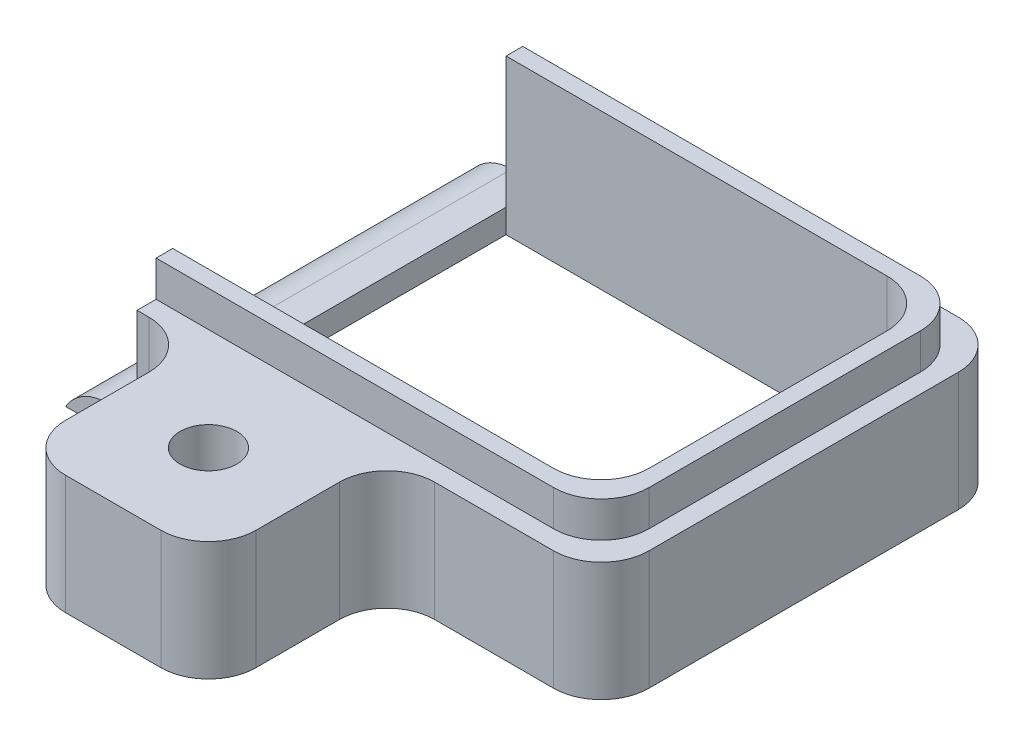
ISO-10303-21;
HEADER;
FILE_DESCRIPTION(('STEP AP214'),'2;1');
FILE_NAME('part.step','',(''),(''),'','','');
FILE_SCHEMA(('AUTOMOTIVE_DESIGN { 1 0 10303 214 1 1 1 1 }'));
ENDSEC;
DATA;
#1=APPLICATION_CONTEXT('core data for automotive mechanical design processes');
#2=APPLICATION_PROTOCOL_DEFINITION('international standard','automotive_design',2000,#1);
#3=PRODUCT_CONTEXT('',#1,'mechanical');
#4=PRODUCT('Part','Part','',(#3));
#5=PRODUCT_RELATED_PRODUCT_CATEGORY('part','',(#4));
#6=PRODUCT_DEFINITION_FORMATION('','',#4);
#7=PRODUCT_DEFINITION_CONTEXT('part definition',#1,'design');
#8=PRODUCT_DEFINITION('design','',#6,#7);
#9=PRODUCT_DEFINITION_SHAPE('','',#8);
#10=(LENGTH_UNIT() NAMED_UNIT(*) SI_UNIT(.MILLI.,.METRE.));
#11=(NAMED_UNIT(*) PLANE_ANGLE_UNIT() SI_UNIT($,.RADIAN.));
#12=(NAMED_UNIT(*) SI_UNIT($,.STERADIAN.) SOLID_ANGLE_UNIT());
#13=UNCERTAINTY_MEASURE_WITH_UNIT(LENGTH_MEASURE(1.E-05),#10,'distance_accuracy_value','');
#14=(GEOMETRIC_REPRESENTATION_CONTEXT(3) GLOBAL_UNCERTAINTY_ASSIGNED_CONTEXT((#13)) GLOBAL_UNIT_ASSIGNED_CONTEXT((#10,
#11,#12)) REPRESENTATION_CONTEXT('',''));
#15=CARTESIAN_POINT('',(0.,0.,0.));
#16=DIRECTION('',(0.,0.,1.));
#17=DIRECTION('',(1.,0.,0.));
#18=AXIS2_PLACEMENT_3D('',#15,#16,#17);
#19=CARTESIAN_POINT('',(5.62499999999999,2.5,-4.25));
#20=DIRECTION('',(0.,-1.,0.));
#21=DIRECTION('',(0.,0.,-1.));
#22=AXIS2_PLACEMENT_3D('',#19,#20,#21);
#23=PLANE('',#22);
#24=CARTESIAN_POINT('',(-0.875000000000002,2.5,6.));
#25=DIRECTION('',(0.,1.,0.));
#26=DIRECTION('',(0.,0.,1.));
#27=AXIS2_PLACEMENT_3D('',#24,#25,#26);
#28=CIRCLE('',#27,0.595629999999989);
#29=CARTESIAN_POINT('',(-0.875000000000002,2.5,6.59562999999999));
#30=VERTEX_POINT('',#29);
#31=EDGE_CURVE('E516',#30,#30,#28,.T.);
#32=ORIENTED_EDGE('',*,*,#31,.F.);
#33=EDGE_LOOP('',(#32));
#34=FACE_BOUND('',#33,.T.);
#35=DIRECTION('',(0.,0.,-1.));
#36=VECTOR('',#35,1.);
#37=CARTESIAN_POINT('',(5.625,2.5,4.25));
#38=LINE('',#37,#36);
#39=CARTESIAN_POINT('',(5.625,2.5,3.25));
#40=VERTEX_POINT('',#39);
#41=CARTESIAN_POINT('',(5.625,2.5,-3.25));
#42=VERTEX_POINT('',#41);
#43=EDGE_CURVE('E308',#40,#42,#38,.T.);
#44=ORIENTED_EDGE('',*,*,#43,.T.);
#45=CARTESIAN_POINT('',(4.625,2.5,-3.25));
#46=DIRECTION('',(0.,-1.,0.));
#47=DIRECTION('',(0.,0.,-1.));
#48=AXIS2_PLACEMENT_3D('',#45,#46,#47);
#49=CIRCLE('',#48,1.);
#50=CARTESIAN_POINT('',(4.62499999999999,2.5,-4.25));
#51=VERTEX_POINT('',#50);
#52=EDGE_CURVE('E367',#42,#51,#49,.F.);
#53=ORIENTED_EDGE('',*,*,#52,.T.);
#54=DIRECTION('',(-1.,0.,0.));
#55=VECTOR('',#54,1.);
#56=CARTESIAN_POINT('',(-5.625,2.5,-4.25));
#57=LINE('',#56,#55);
#58=CARTESIAN_POINT('',(-4.125,2.5,-4.25));
#59=VERTEX_POINT('',#58);
#60=EDGE_CURVE('E311',#51,#59,#57,.T.);
#61=ORIENTED_EDGE('',*,*,#60,.T.);
#62=DIRECTION('',(0.,0.,-1.));
#63=VECTOR('',#62,1.);
#64=CARTESIAN_POINT('',(-4.125,2.5,-4.25));
#65=LINE('',#64,#63);
#66=CARTESIAN_POINT('',(-4.125,2.5,-3.85));
#67=VERTEX_POINT('',#66);
#68=EDGE_CURVE('E294',#67,#59,#65,.T.);
#69=ORIENTED_EDGE('',*,*,#68,.F.);
#70=DIRECTION('',(-1.,0.,0.));
#71=VECTOR('',#70,1.);
#72=CARTESIAN_POINT('',(5.225,2.5,-3.85));
#73=LINE('',#72,#71);
#74=CARTESIAN_POINT('',(4.225,2.5,-3.85));
#75=VERTEX_POINT('',#74);
#76=EDGE_CURVE('E265',#75,#67,#73,.T.);
#77=ORIENTED_EDGE('',*,*,#76,.F.);
#78=CARTESIAN_POINT('',(4.225,2.5,-2.85));
#79=DIRECTION('',(0.,-1.,0.));
#80=DIRECTION('',(0.,0.,-1.));
#81=AXIS2_PLACEMENT_3D('',#78,#79,#80);
#82=CIRCLE('',#81,1.);
#83=CARTESIAN_POINT('',(5.225,2.5,-2.85));
#84=VERTEX_POINT('',#83);
#85=EDGE_CURVE('E415',#75,#84,#82,.T.);
#86=ORIENTED_EDGE('',*,*,#85,.T.);
#87=DIRECTION('',(0.,0.,-1.));
#88=VECTOR('',#87,1.);
#89=CARTESIAN_POINT('',(5.225,2.5,3.85));
#90=LINE('',#89,#88);
#91=CARTESIAN_POINT('',(5.225,2.5,2.85));
#92=VERTEX_POINT('',#91);
#93=EDGE_CURVE('E262',#92,#84,#90,.T.);
#94=ORIENTED_EDGE('',*,*,#93,.F.);
#95=CARTESIAN_POINT('',(4.225,2.5,2.85));
#96=DIRECTION('',(0.,-1.,0.));
#97=DIRECTION('',(0.,0.,-1.));
#98=AXIS2_PLACEMENT_3D('',#95,#96,#97);
#99=CIRCLE('',#98,1.);
#100=CARTESIAN_POINT('',(4.225,2.5,3.85));
#101=VERTEX_POINT('',#100);
#102=EDGE_CURVE('E417',#92,#101,#99,.T.);
#103=ORIENTED_EDGE('',*,*,#102,.T.);
#104=DIRECTION('',(1.,0.,0.));
#105=VECTOR('',#104,1.);
#106=CARTESIAN_POINT('',(-4.125,2.5,3.85));
#107=LINE('',#106,#105);
#108=CARTESIAN_POINT('',(-4.125,2.5,3.85));
#109=VERTEX_POINT('',#108);
#110=EDGE_CURVE('E266',#109,#101,#107,.T.);
#111=ORIENTED_EDGE('',*,*,#110,.F.);
#112=CARTESIAN_POINT('',(-4.125,2.5,4.25));
#113=VERTEX_POINT('',#112);
#114=EDGE_CURVE('E290',#113,#109,#65,.T.);
#115=ORIENTED_EDGE('',*,*,#114,.F.);
#116=DIRECTION('',(1.,0.,0.));
#117=VECTOR('',#116,1.);
#118=CARTESIAN_POINT('',(-5.625,2.5,4.25));
#119=LINE('',#118,#117);
#120=CARTESIAN_POINT('',(-3.875,2.5,4.25));
#121=VERTEX_POINT('',#120);
#122=EDGE_CURVE('E321',#113,#121,#119,.T.);
#123=ORIENTED_EDGE('',*,*,#122,.T.);
#124=CARTESIAN_POINT('',(-3.875,2.5,5.25));
#125=DIRECTION('',(0.,-1.,0.));
#126=DIRECTION('',(0.,0.,-1.));
#127=AXIS2_PLACEMENT_3D('',#124,#125,#126);
#128=CIRCLE('',#127,1.);
#129=CARTESIAN_POINT('',(-2.875,2.5,5.25));
#130=VERTEX_POINT('',#129);
#131=EDGE_CURVE('E425',#121,#130,#128,.T.);
#132=ORIENTED_EDGE('',*,*,#131,.T.);
#133=DIRECTION('',(0.,0.,-1.));
#134=VECTOR('',#133,1.);
#135=CARTESIAN_POINT('',(-2.875,2.5,8.));
#136=LINE('',#135,#134);
#137=CARTESIAN_POINT('',(-2.875,2.5,7.));
#138=VERTEX_POINT('',#137);
#139=EDGE_CURVE('E277',#138,#130,#136,.T.);
#140=ORIENTED_EDGE('',*,*,#139,.F.);
#141=CARTESIAN_POINT('',(-1.875,2.5,7.));
#142=DIRECTION('',(0.,-1.,0.));
#143=DIRECTION('',(0.,0.,-1.));
#144=AXIS2_PLACEMENT_3D('',#141,#142,#143);
#145=CIRCLE('',#144,1.);
#146=CARTESIAN_POINT('',(-1.875,2.5,8.));
#147=VERTEX_POINT('',#146);
#148=EDGE_CURVE('E358',#138,#147,#145,.F.);
#149=ORIENTED_EDGE('',*,*,#148,.T.);
#150=DIRECTION('',(-1.,0.,0.));
#151=VECTOR('',#150,1.);
#152=CARTESIAN_POINT('',(-2.875,2.5,8.));
#153=LINE('',#152,#151);
#154=CARTESIAN_POINT('',(0.124999999999998,2.5,8.));
#155=VERTEX_POINT('',#154);
#156=EDGE_CURVE('E282',#155,#147,#153,.T.);
#157=ORIENTED_EDGE('',*,*,#156,.F.);
#158=CARTESIAN_POINT('',(0.124999999999998,2.5,7.));
#159=DIRECTION('',(0.,-1.,0.));
#160=DIRECTION('',(0.,0.,-1.));
#161=AXIS2_PLACEMENT_3D('',#158,#159,#160);
#162=CIRCLE('',#161,1.);
#163=CARTESIAN_POINT('',(1.125,2.5,7.));
#164=VERTEX_POINT('',#163);
#165=EDGE_CURVE('E356',#155,#164,#162,.F.);
#166=ORIENTED_EDGE('',*,*,#165,.T.);
#167=DIRECTION('',(0.,0.,-1.));
#168=VECTOR('',#167,1.);
#169=CARTESIAN_POINT('',(1.125,2.5,8.));
#170=LINE('',#169,#168);
#171=CARTESIAN_POINT('',(1.125,2.5,5.25));
#172=VERTEX_POINT('',#171);
#173=EDGE_CURVE('E281',#164,#172,#170,.T.);
#174=ORIENTED_EDGE('',*,*,#173,.T.);
#175=CARTESIAN_POINT('',(2.125,2.5,5.25));
#176=DIRECTION('',(0.,-1.,0.));
#177=DIRECTION('',(0.,0.,-1.));
#178=AXIS2_PLACEMENT_3D('',#175,#176,#177);
#179=CIRCLE('',#178,1.);
#180=CARTESIAN_POINT('',(2.125,2.5,4.25));
#181=VERTEX_POINT('',#180);
#182=EDGE_CURVE('E419',#172,#181,#179,.T.);
#183=ORIENTED_EDGE('',*,*,#182,.T.);
#184=CARTESIAN_POINT('',(4.62499999999999,2.5,4.25));
#185=VERTEX_POINT('',#184);
#186=EDGE_CURVE('E314',#181,#185,#119,.T.);
#187=ORIENTED_EDGE('',*,*,#186,.T.);
#188=CARTESIAN_POINT('',(4.625,2.5,3.25));
#189=DIRECTION('',(0.,-1.,0.));
#190=DIRECTION('',(0.,0.,-1.));
#191=AXIS2_PLACEMENT_3D('',#188,#189,#190);
#192=CIRCLE('',#191,1.);
#193=EDGE_CURVE('E363',#185,#40,#192,.F.);
#194=ORIENTED_EDGE('',*,*,#193,.T.);
#195=EDGE_LOOP('',(#44,#53,#61,#69,#77,#86,#94,#103,#111,#115,#123,#132,#140,#149,#157,#166,
#174,#183,#187,#194));
#196=FACE_BOUND('',#195,.T.);
#197=ADVANCED_FACE('F30',(#34,#196),#23,.F.);
#198=CARTESIAN_POINT('',(-5.625,2.5,4.25));
#199=DIRECTION('',(0.,0.,-1.));
#200=DIRECTION('',(-1.,0.,0.));
#201=AXIS2_PLACEMENT_3D('',#198,#199,#200);
#202=PLANE('',#201);
#203=DIRECTION('',(1.,0.,0.));
#204=VECTOR('',#203,1.);
#205=CARTESIAN_POINT('',(-5.625,0.5,4.25));
#206=LINE('',#205,#204);
#207=CARTESIAN_POINT('',(-4.75897459621556,0.5,4.25));
#208=VERTEX_POINT('',#207);
#209=CARTESIAN_POINT('',(-4.125,0.5,4.25));
#210=VERTEX_POINT('',#209);
#211=EDGE_CURVE('E293',#208,#210,#206,.T.);
#212=ORIENTED_EDGE('',*,*,#211,.F.);
#213=CARTESIAN_POINT('',(-4.75897459621556,-0.5,4.25));
#214=DIRECTION('',(0.,0.,-1.));
#215=DIRECTION('',(-1.,0.,0.));
#216=AXIS2_PLACEMENT_3D('',#213,#214,#215);
#217=CIRCLE('',#216,1.);
#218=CARTESIAN_POINT('',(-5.625,0.,4.25));
#219=VERTEX_POINT('',#218);
#220=EDGE_CURVE('E38',#208,#219,#217,.F.);
#221=ORIENTED_EDGE('',*,*,#220,.T.);
#222=DIRECTION('',(1.,0.,0.));
#223=VECTOR('',#222,1.);
#224=CARTESIAN_POINT('',(-5.625,0.,4.25));
#225=LINE('',#224,#223);
#226=CARTESIAN_POINT('',(-3.875,0.,4.25));
#227=VERTEX_POINT('',#226);
#228=EDGE_CURVE('E312',#219,#227,#225,.T.);
#229=ORIENTED_EDGE('',*,*,#228,.T.);
#230=DIRECTION('',(0.,-1.,0.));
#231=VECTOR('',#230,1.);
#232=CARTESIAN_POINT('',(-3.875,2.5,4.25));
#233=LINE('',#232,#231);
#234=EDGE_CURVE('E403',#227,#121,#233,.F.);
#235=ORIENTED_EDGE('',*,*,#234,.T.);
#236=ORIENTED_EDGE('',*,*,#122,.F.);
#237=DIRECTION('',(0.,1.,0.));
#238=VECTOR('',#237,1.);
#239=CARTESIAN_POINT('',(-4.125,0.5,4.25));
#240=LINE('',#239,#238);
#241=EDGE_CURVE('E306',#210,#113,#240,.T.);
#242=ORIENTED_EDGE('',*,*,#241,.F.);
#243=EDGE_LOOP('',(#212,#221,#229,#235,#236,#242));
#244=FACE_BOUND('',#243,.T.);
#245=ADVANCED_FACE('F438',(#244),#202,.F.);
#246=CARTESIAN_POINT('',(2.125,0.,4.25));
#247=VERTEX_POINT('',#246);
#248=CARTESIAN_POINT('',(4.62499999999999,0.,4.25));
#249=VERTEX_POINT('',#248);
#250=EDGE_CURVE('E329',#247,#249,#225,.T.);
#251=ORIENTED_EDGE('',*,*,#250,.T.);
#252=DIRECTION('',(0.,-1.,0.));
#253=VECTOR('',#252,1.);
#254=CARTESIAN_POINT('',(4.625,2.5,4.25));
#255=LINE('',#254,#253);
#256=EDGE_CURVE('E383',#249,#185,#255,.F.);
#257=ORIENTED_EDGE('',*,*,#256,.T.);
#258=ORIENTED_EDGE('',*,*,#186,.F.);
#259=DIRECTION('',(0.,1.,0.));
#260=VECTOR('',#259,1.);
#261=CARTESIAN_POINT('',(2.125,0.,4.25));
#262=LINE('',#261,#260);
#263=EDGE_CURVE('E381',#181,#247,#262,.F.);
#264=ORIENTED_EDGE('',*,*,#263,.T.);
#265=EDGE_LOOP('',(#251,#257,#258,#264));
#266=FACE_BOUND('',#265,.T.);
#267=ADVANCED_FACE('F565',(#266),#202,.F.);
#268=CARTESIAN_POINT('',(-4.125,0.5,-4.25));
#269=DIRECTION('',(1.,0.,0.));
#270=DIRECTION('',(0.,0.,-1.));
#271=AXIS2_PLACEMENT_3D('',#268,#269,#270);
#272=PLANE('',#271);
#273=ORIENTED_EDGE('',*,*,#114,.T.);
#274=DIRECTION('',(0.,-1.,0.));
#275=VECTOR('',#274,1.);
#276=CARTESIAN_POINT('',(-4.125,3.25,3.85));
#277=LINE('',#276,#275);
#278=CARTESIAN_POINT('',(-4.125,3.25,3.85));
#279=VERTEX_POINT('',#278);
#280=EDGE_CURVE('E247',#279,#109,#277,.T.);
#281=ORIENTED_EDGE('',*,*,#280,.F.);
#282=DIRECTION('',(0.,0.,1.));
#283=VECTOR('',#282,1.);
#284=CARTESIAN_POINT('',(-4.125,3.25,3.5));
#285=LINE('',#284,#283);
#286=CARTESIAN_POINT('',(-4.125,3.25,3.5));
#287=VERTEX_POINT('',#286);
#288=EDGE_CURVE('E225',#287,#279,#285,.T.);
#289=ORIENTED_EDGE('',*,*,#288,.F.);
#290=DIRECTION('',(0.,1.,0.));
#291=VECTOR('',#290,1.);
#292=CARTESIAN_POINT('',(-4.125,0.,3.5));
#293=LINE('',#292,#291);
#294=CARTESIAN_POINT('',(-4.125,0.5,3.5));
#295=VERTEX_POINT('',#294);
#296=EDGE_CURVE('E235',#295,#287,#293,.T.);
#297=ORIENTED_EDGE('',*,*,#296,.F.);
#298=DIRECTION('',(0.,0.,-1.));
#299=VECTOR('',#298,1.);
#300=CARTESIAN_POINT('',(-4.125,0.5,-4.25));
#301=LINE('',#300,#299);
#302=EDGE_CURVE('E474',#210,#295,#301,.T.);
#303=ORIENTED_EDGE('',*,*,#302,.F.);
#304=ORIENTED_EDGE('',*,*,#241,.T.);
#305=EDGE_LOOP('',(#273,#281,#289,#297,#303,#304));
#306=FACE_BOUND('',#305,.T.);
#307=ADVANCED_FACE('F245',(#306),#272,.F.);
#308=CARTESIAN_POINT('',(5.625,2.5,4.25));
#309=DIRECTION('',(-1.,0.,0.));
#310=DIRECTION('',(0.,0.,1.));
#311=AXIS2_PLACEMENT_3D('',#308,#309,#310);
#312=PLANE('',#311);
#313=DIRECTION('',(0.,0.,-1.));
#314=VECTOR('',#313,1.);
#315=CARTESIAN_POINT('',(5.625,0.,4.25));
#316=LINE('',#315,#314);
#317=CARTESIAN_POINT('',(5.625,0.,3.25));
#318=VERTEX_POINT('',#317);
#319=CARTESIAN_POINT('',(5.625,0.,-3.25));
#320=VERTEX_POINT('',#319);
#321=EDGE_CURVE('E305',#318,#320,#316,.T.);
#322=ORIENTED_EDGE('',*,*,#321,.T.);
#323=DIRECTION('',(0.,-1.,0.));
#324=VECTOR('',#323,1.);
#325=CARTESIAN_POINT('',(5.625,2.5,-3.25));
#326=LINE('',#325,#324);
#327=EDGE_CURVE('E275',#320,#42,#326,.F.);
#328=ORIENTED_EDGE('',*,*,#327,.T.);
#329=ORIENTED_EDGE('',*,*,#43,.F.);
#330=DIRECTION('',(0.,-1.,0.));
#331=VECTOR('',#330,1.);
#332=CARTESIAN_POINT('',(5.625,2.5,3.25));
#333=LINE('',#332,#331);
#334=EDGE_CURVE('E349',#40,#318,#333,.T.);
#335=ORIENTED_EDGE('',*,*,#334,.T.);
#336=EDGE_LOOP('',(#322,#328,#329,#335));
#337=FACE_BOUND('',#336,.T.);
#338=ADVANCED_FACE('F449',(#337),#312,.F.);
#339=CARTESIAN_POINT('',(-5.625,2.5,-4.25));
#340=DIRECTION('',(0.,0.,1.));
#341=DIRECTION('',(1.,0.,0.));
#342=AXIS2_PLACEMENT_3D('',#339,#340,#341);
#343=PLANE('',#342);
#344=DIRECTION('',(-1.,0.,0.));
#345=VECTOR('',#344,1.);
#346=CARTESIAN_POINT('',(-5.625,0.,-4.25));
#347=LINE('',#346,#345);
#348=CARTESIAN_POINT('',(4.62499999999999,0.,-4.25));
#349=VERTEX_POINT('',#348);
#350=CARTESIAN_POINT('',(-5.625,0.,-4.25));
#351=VERTEX_POINT('',#350);
#352=EDGE_CURVE('E446',#349,#351,#347,.T.);
#353=ORIENTED_EDGE('',*,*,#352,.T.);
#354=CARTESIAN_POINT('',(-4.75897459621556,-0.5,-4.25));
#355=DIRECTION('',(0.,0.,1.));
#356=DIRECTION('',(1.,0.,0.));
#357=AXIS2_PLACEMENT_3D('',#354,#355,#356);
#358=CIRCLE('',#357,1.);
#359=CARTESIAN_POINT('',(-4.75897459621556,0.5,-4.25));
#360=VERTEX_POINT('',#359);
#361=EDGE_CURVE('E11',#351,#360,#358,.F.);
#362=ORIENTED_EDGE('',*,*,#361,.T.);
#363=DIRECTION('',(-1.,0.,0.));
#364=VECTOR('',#363,1.);
#365=CARTESIAN_POINT('',(-5.625,0.5,-4.25));
#366=LINE('',#365,#364);
#367=CARTESIAN_POINT('',(-4.125,0.5,-4.25));
#368=VERTEX_POINT('',#367);
#369=EDGE_CURVE('E299',#368,#360,#366,.T.);
#370=ORIENTED_EDGE('',*,*,#369,.F.);
#371=DIRECTION('',(0.,1.,0.));
#372=VECTOR('',#371,1.);
#373=CARTESIAN_POINT('',(-4.125,0.5,-4.25));
#374=LINE('',#373,#372);
#375=EDGE_CURVE('E301',#368,#59,#374,.T.);
#376=ORIENTED_EDGE('',*,*,#375,.T.);
#377=ORIENTED_EDGE('',*,*,#60,.F.);
#378=DIRECTION('',(0.,-1.,0.));
#379=VECTOR('',#378,1.);
#380=CARTESIAN_POINT('',(4.625,2.5,-4.25));
#381=LINE('',#380,#379);
#382=EDGE_CURVE('E325',#51,#349,#381,.T.);
#383=ORIENTED_EDGE('',*,*,#382,.T.);
#384=EDGE_LOOP('',(#353,#362,#370,#376,#377,#383));
#385=FACE_BOUND('',#384,.T.);
#386=ADVANCED_FACE('F457',(#385),#343,.F.);
#387=CARTESIAN_POINT('',(5.62499999999999,0.,-4.25));
#388=DIRECTION('',(0.,-1.,0.));
#389=DIRECTION('',(0.,0.,-1.));
#390=AXIS2_PLACEMENT_3D('',#387,#388,#389);
#391=PLANE('',#390);
#392=CARTESIAN_POINT('',(-0.875000000000002,0.,6.));
#393=DIRECTION('',(0.,-1.,0.));
#394=DIRECTION('',(0.,0.,-1.));
#395=AXIS2_PLACEMENT_3D('',#392,#393,#394);
#396=CIRCLE('',#395,0.595629999999984);
#397=CARTESIAN_POINT('',(-0.875000000000002,0.,5.40437000000002));
#398=VERTEX_POINT('',#397);
#399=EDGE_CURVE('E514',#398,#398,#396,.T.);
#400=ORIENTED_EDGE('',*,*,#399,.F.);
#401=EDGE_LOOP('',(#400));
#402=FACE_BOUND('',#401,.T.);
#403=DIRECTION('',(1.,0.,0.));
#404=VECTOR('',#403,1.);
#405=CARTESIAN_POINT('',(4.875,0.,3.5));
#406=LINE('',#405,#404);
#407=CARTESIAN_POINT('',(-4.125,0.,3.5));
#408=VERTEX_POINT('',#407);
#409=CARTESIAN_POINT('',(3.875,0.,3.5));
#410=VERTEX_POINT('',#409);
#411=EDGE_CURVE('E470',#408,#410,#406,.T.);
#412=ORIENTED_EDGE('',*,*,#411,.T.);
#413=CARTESIAN_POINT('',(3.875,0.,2.5));
#414=DIRECTION('',(0.,-1.,0.));
#415=DIRECTION('',(0.,0.,-1.));
#416=AXIS2_PLACEMENT_3D('',#413,#414,#415);
#417=CIRCLE('',#416,1.);
#418=CARTESIAN_POINT('',(4.875,0.,2.5));
#419=VERTEX_POINT('',#418);
#420=EDGE_CURVE('E428',#410,#419,#417,.F.);
#421=ORIENTED_EDGE('',*,*,#420,.T.);
#422=DIRECTION('',(0.,0.,-1.));
#423=VECTOR('',#422,1.);
#424=CARTESIAN_POINT('',(4.875,0.,-3.5));
#425=LINE('',#424,#423);
#426=CARTESIAN_POINT('',(4.875,0.,-2.5));
#427=VERTEX_POINT('',#426);
#428=EDGE_CURVE('E341',#419,#427,#425,.T.);
#429=ORIENTED_EDGE('',*,*,#428,.T.);
#430=CARTESIAN_POINT('',(3.875,0.,-2.5));
#431=DIRECTION('',(0.,-1.,0.));
#432=DIRECTION('',(0.,0.,-1.));
#433=AXIS2_PLACEMENT_3D('',#430,#431,#432);
#434=CIRCLE('',#433,1.);
#435=CARTESIAN_POINT('',(3.875,0.,-3.5));
#436=VERTEX_POINT('',#435);
#437=EDGE_CURVE('E432',#427,#436,#434,.F.);
#438=ORIENTED_EDGE('',*,*,#437,.T.);
#439=DIRECTION('',(-1.,0.,0.));
#440=VECTOR('',#439,1.);
#441=CARTESIAN_POINT('',(4.875,0.,-3.5));
#442=LINE('',#441,#440);
#443=CARTESIAN_POINT('',(-4.125,0.,-3.5));
#444=VERTEX_POINT('',#443);
#445=EDGE_CURVE('E493',#436,#444,#442,.T.);
#446=ORIENTED_EDGE('',*,*,#445,.T.);
#447=DIRECTION('',(0.,0.,1.));
#448=VECTOR('',#447,1.);
#449=CARTESIAN_POINT('',(-4.125,0.,-3.5));
#450=LINE('',#449,#448);
#451=EDGE_CURVE('E484',#444,#408,#450,.T.);
#452=ORIENTED_EDGE('',*,*,#451,.T.);
#453=EDGE_LOOP('',(#412,#421,#429,#438,#446,#452));
#454=FACE_BOUND('',#453,.T.);
#455=ORIENTED_EDGE('',*,*,#352,.F.);
#456=CARTESIAN_POINT('',(4.625,0.,-3.25));
#457=DIRECTION('',(0.,-1.,0.));
#458=DIRECTION('',(0.,0.,-1.));
#459=AXIS2_PLACEMENT_3D('',#456,#457,#458);
#460=CIRCLE('',#459,1.);
#461=EDGE_CURVE('E348',#349,#320,#460,.T.);
#462=ORIENTED_EDGE('',*,*,#461,.T.);
#463=ORIENTED_EDGE('',*,*,#321,.F.);
#464=CARTESIAN_POINT('',(4.625,0.,3.25));
#465=DIRECTION('',(0.,-1.,0.));
#466=DIRECTION('',(0.,0.,-1.));
#467=AXIS2_PLACEMENT_3D('',#464,#465,#466);
#468=CIRCLE('',#467,1.);
#469=EDGE_CURVE('E346',#318,#249,#468,.T.);
#470=ORIENTED_EDGE('',*,*,#469,.T.);
#471=ORIENTED_EDGE('',*,*,#250,.F.);
#472=CARTESIAN_POINT('',(2.125,0.,5.25));
#473=DIRECTION('',(0.,-1.,0.));
#474=DIRECTION('',(0.,0.,-1.));
#475=AXIS2_PLACEMENT_3D('',#472,#473,#474);
#476=CIRCLE('',#475,1.);
#477=CARTESIAN_POINT('',(1.125,0.,5.25));
#478=VERTEX_POINT('',#477);
#479=EDGE_CURVE('E421',#247,#478,#476,.F.);
#480=ORIENTED_EDGE('',*,*,#479,.T.);
#481=DIRECTION('',(0.,0.,-1.));
#482=VECTOR('',#481,1.);
#483=CARTESIAN_POINT('',(1.125,0.,8.));
#484=LINE('',#483,#482);
#485=CARTESIAN_POINT('',(1.125,0.,7.));
#486=VERTEX_POINT('',#485);
#487=EDGE_CURVE('E333',#486,#478,#484,.T.);
#488=ORIENTED_EDGE('',*,*,#487,.F.);
#489=CARTESIAN_POINT('',(0.124999999999998,0.,7.));
#490=DIRECTION('',(0.,-1.,0.));
#491=DIRECTION('',(0.,0.,-1.));
#492=AXIS2_PLACEMENT_3D('',#489,#490,#491);
#493=CIRCLE('',#492,1.);
#494=CARTESIAN_POINT('',(0.124999999999998,0.,8.));
#495=VERTEX_POINT('',#494);
#496=EDGE_CURVE('E342',#486,#495,#493,.T.);
#497=ORIENTED_EDGE('',*,*,#496,.T.);
#498=DIRECTION('',(1.,0.,0.));
#499=VECTOR('',#498,1.);
#500=CARTESIAN_POINT('',(-2.875,0.,8.));
#501=LINE('',#500,#499);
#502=CARTESIAN_POINT('',(-1.875,0.,8.));
#503=VERTEX_POINT('',#502);
#504=EDGE_CURVE('E269',#503,#495,#501,.T.);
#505=ORIENTED_EDGE('',*,*,#504,.F.);
#506=CARTESIAN_POINT('',(-1.875,0.,7.));
#507=DIRECTION('',(0.,-1.,0.));
#508=DIRECTION('',(0.,0.,-1.));
#509=AXIS2_PLACEMENT_3D('',#506,#507,#508);
#510=CIRCLE('',#509,1.);
#511=CARTESIAN_POINT('',(-2.875,0.,7.));
#512=VERTEX_POINT('',#511);
#513=EDGE_CURVE('E344',#503,#512,#510,.T.);
#514=ORIENTED_EDGE('',*,*,#513,.T.);
#515=DIRECTION('',(0.,0.,-1.));
#516=VECTOR('',#515,1.);
#517=CARTESIAN_POINT('',(-2.875,0.,8.));
#518=LINE('',#517,#516);
#519=CARTESIAN_POINT('',(-2.875,0.,5.25));
#520=VERTEX_POINT('',#519);
#521=EDGE_CURVE('E337',#512,#520,#518,.T.);
#522=ORIENTED_EDGE('',*,*,#521,.T.);
#523=CARTESIAN_POINT('',(-3.875,0.,5.25));
#524=DIRECTION('',(0.,-1.,0.));
#525=DIRECTION('',(0.,0.,-1.));
#526=AXIS2_PLACEMENT_3D('',#523,#524,#525);
#527=CIRCLE('',#526,1.);
#528=EDGE_CURVE('E423',#520,#227,#527,.F.);
#529=ORIENTED_EDGE('',*,*,#528,.T.);
#530=ORIENTED_EDGE('',*,*,#228,.F.);
#531=DIRECTION('',(0.,0.,1.));
#532=VECTOR('',#531,1.);
#533=CARTESIAN_POINT('',(-5.625,0.,4.25));
#534=LINE('',#533,#532);
#535=EDGE_CURVE('E445',#351,#219,#534,.T.);
#536=ORIENTED_EDGE('',*,*,#535,.F.);
#537=EDGE_LOOP('',(#455,#462,#463,#470,#471,#480,#488,#497,#505,#514,#522,#529,#530,#536));
#538=FACE_BOUND('',#537,.T.);
#539=ADVANCED_FACE('F444',(#402,#454,#538),#391,.T.);
#540=CARTESIAN_POINT('',(-4.125,0.5,-3.5));
#541=VERTEX_POINT('',#540);
#542=EDGE_CURVE('E462',#541,#368,#301,.T.);
#543=ORIENTED_EDGE('',*,*,#542,.F.);
#544=DIRECTION('',(0.,1.,0.));
#545=VECTOR('',#544,1.);
#546=CARTESIAN_POINT('',(-4.125,0.,-3.5));
#547=LINE('',#546,#545);
#548=CARTESIAN_POINT('',(-4.125,3.25,-3.5));
#549=VERTEX_POINT('',#548);
#550=EDGE_CURVE('E473',#541,#549,#547,.T.);
#551=ORIENTED_EDGE('',*,*,#550,.T.);
#552=DIRECTION('',(0.,0.,1.));
#553=VECTOR('',#552,1.);
#554=CARTESIAN_POINT('',(-4.125,3.25,-3.85));
#555=LINE('',#554,#553);
#556=CARTESIAN_POINT('',(-4.125,3.25,-3.85));
#557=VERTEX_POINT('',#556);
#558=EDGE_CURVE('E258',#557,#549,#555,.T.);
#559=ORIENTED_EDGE('',*,*,#558,.F.);
#560=DIRECTION('',(0.,-1.,0.));
#561=VECTOR('',#560,1.);
#562=CARTESIAN_POINT('',(-4.125,3.25,-3.85));
#563=LINE('',#562,#561);
#564=EDGE_CURVE('E261',#557,#67,#563,.T.);
#565=ORIENTED_EDGE('',*,*,#564,.T.);
#566=ORIENTED_EDGE('',*,*,#68,.T.);
#567=ORIENTED_EDGE('',*,*,#375,.F.);
#568=EDGE_LOOP('',(#543,#551,#559,#565,#566,#567));
#569=FACE_BOUND('',#568,.T.);
#570=ADVANCED_FACE('F461',(#569),#272,.F.);
#571=CARTESIAN_POINT('',(-5.625,0.5,4.25));
#572=DIRECTION('',(0.,1.,0.));
#573=DIRECTION('',(0.,0.,1.));
#574=AXIS2_PLACEMENT_3D('',#571,#572,#573);
#575=PLANE('',#574);
#576=ORIENTED_EDGE('',*,*,#369,.T.);
#577=DIRECTION('',(0.,0.,1.));
#578=VECTOR('',#577,1.);
#579=CARTESIAN_POINT('',(-4.75897459621556,0.5,4.25));
#580=LINE('',#579,#578);
#581=EDGE_CURVE('E434',#360,#208,#580,.T.);
#582=ORIENTED_EDGE('',*,*,#581,.T.);
#583=ORIENTED_EDGE('',*,*,#211,.T.);
#584=ORIENTED_EDGE('',*,*,#302,.T.);
#585=EDGE_CURVE('E475',#295,#541,#301,.T.);
#586=ORIENTED_EDGE('',*,*,#585,.T.);
#587=ORIENTED_EDGE('',*,*,#542,.T.);
#588=EDGE_LOOP('',(#576,#582,#583,#584,#586,#587));
#589=FACE_BOUND('',#588,.T.);
#590=ADVANCED_FACE('F477',(#589),#575,.T.);
#591=CARTESIAN_POINT('',(4.875,0.,-3.5));
#592=DIRECTION('',(1.,0.,0.));
#593=DIRECTION('',(0.,0.,-1.));
#594=AXIS2_PLACEMENT_3D('',#591,#592,#593);
#595=PLANE('',#594);
#596=ORIENTED_EDGE('',*,*,#428,.F.);
#597=DIRECTION('',(0.,1.,0.));
#598=VECTOR('',#597,1.);
#599=CARTESIAN_POINT('',(4.875,3.25,2.5));
#600=LINE('',#599,#598);
#601=CARTESIAN_POINT('',(4.875,3.25,2.5));
#602=VERTEX_POINT('',#601);
#603=EDGE_CURVE('E407',#419,#602,#600,.T.);
#604=ORIENTED_EDGE('',*,*,#603,.T.);
#605=DIRECTION('',(0.,0.,1.));
#606=VECTOR('',#605,1.);
#607=CARTESIAN_POINT('',(4.875,3.25,-3.5));
#608=LINE('',#607,#606);
#609=CARTESIAN_POINT('',(4.875,3.25,-2.5));
#610=VERTEX_POINT('',#609);
#611=EDGE_CURVE('E231',#610,#602,#608,.T.);
#612=ORIENTED_EDGE('',*,*,#611,.F.);
#613=DIRECTION('',(0.,1.,0.));
#614=VECTOR('',#613,1.);
#615=CARTESIAN_POINT('',(4.875,0.,-2.5));
#616=LINE('',#615,#614);
#617=EDGE_CURVE('E405',#610,#427,#616,.F.);
#618=ORIENTED_EDGE('',*,*,#617,.T.);
#619=EDGE_LOOP('',(#596,#604,#612,#618));
#620=FACE_BOUND('',#619,.T.);
#621=ADVANCED_FACE('F528',(#620),#595,.F.);
#622=CARTESIAN_POINT('',(4.875,0.,3.5));
#623=DIRECTION('',(0.,0.,1.));
#624=DIRECTION('',(1.,0.,0.));
#625=AXIS2_PLACEMENT_3D('',#622,#623,#624);
#626=PLANE('',#625);
#627=DIRECTION('',(-1.,0.,0.));
#628=VECTOR('',#627,1.);
#629=CARTESIAN_POINT('',(4.875,3.25,3.5));
#630=LINE('',#629,#628);
#631=CARTESIAN_POINT('',(3.875,3.25,3.5));
#632=VERTEX_POINT('',#631);
#633=EDGE_CURVE('E219',#632,#287,#630,.T.);
#634=ORIENTED_EDGE('',*,*,#633,.F.);
#635=DIRECTION('',(0.,1.,0.));
#636=VECTOR('',#635,1.);
#637=CARTESIAN_POINT('',(3.875,0.,3.5));
#638=LINE('',#637,#636);
#639=EDGE_CURVE('E410',#632,#410,#638,.F.);
#640=ORIENTED_EDGE('',*,*,#639,.T.);
#641=ORIENTED_EDGE('',*,*,#411,.F.);
#642=EDGE_CURVE('E238',#408,#295,#293,.T.);
#643=ORIENTED_EDGE('',*,*,#642,.T.);
#644=ORIENTED_EDGE('',*,*,#296,.T.);
#645=EDGE_LOOP('',(#634,#640,#641,#643,#644));
#646=FACE_BOUND('',#645,.T.);
#647=ADVANCED_FACE('F236',(#646),#626,.F.);
#648=CARTESIAN_POINT('',(-4.125,0.,-3.5));
#649=DIRECTION('',(-1.,0.,0.));
#650=DIRECTION('',(0.,0.,1.));
#651=AXIS2_PLACEMENT_3D('',#648,#649,#650);
#652=PLANE('',#651);
#653=ORIENTED_EDGE('',*,*,#585,.F.);
#654=ORIENTED_EDGE('',*,*,#642,.F.);
#655=ORIENTED_EDGE('',*,*,#451,.F.);
#656=EDGE_CURVE('E242',#444,#541,#547,.T.);
#657=ORIENTED_EDGE('',*,*,#656,.T.);
#658=EDGE_LOOP('',(#653,#654,#655,#657));
#659=FACE_BOUND('',#658,.T.);
#660=ADVANCED_FACE('F479',(#659),#652,.F.);
#661=CARTESIAN_POINT('',(4.875,0.,-3.5));
#662=DIRECTION('',(0.,0.,-1.));
#663=DIRECTION('',(-1.,0.,0.));
#664=AXIS2_PLACEMENT_3D('',#661,#662,#663);
#665=PLANE('',#664);
#666=ORIENTED_EDGE('',*,*,#445,.F.);
#667=DIRECTION('',(0.,1.,0.));
#668=VECTOR('',#667,1.);
#669=CARTESIAN_POINT('',(3.875,3.25,-3.5));
#670=LINE('',#669,#668);
#671=CARTESIAN_POINT('',(3.875,3.25,-3.5));
#672=VERTEX_POINT('',#671);
#673=EDGE_CURVE('E412',#436,#672,#670,.T.);
#674=ORIENTED_EDGE('',*,*,#673,.T.);
#675=DIRECTION('',(1.,0.,0.));
#676=VECTOR('',#675,1.);
#677=CARTESIAN_POINT('',(-4.125,3.25,-3.5));
#678=LINE('',#677,#676);
#679=EDGE_CURVE('E274',#549,#672,#678,.T.);
#680=ORIENTED_EDGE('',*,*,#679,.F.);
#681=ORIENTED_EDGE('',*,*,#550,.F.);
#682=ORIENTED_EDGE('',*,*,#656,.F.);
#683=EDGE_LOOP('',(#666,#674,#680,#681,#682));
#684=FACE_BOUND('',#683,.T.);
#685=ADVANCED_FACE('F488',(#684),#665,.F.);
#686=CARTESIAN_POINT('',(-2.875,0.,8.));
#687=DIRECTION('',(1.,0.,0.));
#688=DIRECTION('',(0.,0.,-1.));
#689=AXIS2_PLACEMENT_3D('',#686,#687,#688);
#690=PLANE('',#689);
#691=ORIENTED_EDGE('',*,*,#521,.F.);
#692=DIRECTION('',(0.,-1.,0.));
#693=VECTOR('',#692,1.);
#694=CARTESIAN_POINT('',(-2.875,0.,7.));
#695=LINE('',#694,#693);
#696=EDGE_CURVE('E396',#512,#138,#695,.F.);
#697=ORIENTED_EDGE('',*,*,#696,.T.);
#698=ORIENTED_EDGE('',*,*,#139,.T.);
#699=DIRECTION('',(0.,-1.,0.));
#700=VECTOR('',#699,1.);
#701=CARTESIAN_POINT('',(-2.875,0.,5.25));
#702=LINE('',#701,#700);
#703=EDGE_CURVE('E393',#130,#520,#702,.T.);
#704=ORIENTED_EDGE('',*,*,#703,.T.);
#705=EDGE_LOOP('',(#691,#697,#698,#704));
#706=FACE_BOUND('',#705,.T.);
#707=ADVANCED_FACE('F594',(#706),#690,.F.);
#708=CARTESIAN_POINT('',(1.125,0.,8.));
#709=DIRECTION('',(-1.,0.,0.));
#710=DIRECTION('',(0.,0.,1.));
#711=AXIS2_PLACEMENT_3D('',#708,#709,#710);
#712=PLANE('',#711);
#713=ORIENTED_EDGE('',*,*,#173,.F.);
#714=DIRECTION('',(0.,1.,0.));
#715=VECTOR('',#714,1.);
#716=CARTESIAN_POINT('',(1.125,0.,7.));
#717=LINE('',#716,#715);
#718=EDGE_CURVE('E401',#164,#486,#717,.F.);
#719=ORIENTED_EDGE('',*,*,#718,.T.);
#720=ORIENTED_EDGE('',*,*,#487,.T.);
#721=DIRECTION('',(0.,1.,0.));
#722=VECTOR('',#721,1.);
#723=CARTESIAN_POINT('',(1.125,2.5,5.25));
#724=LINE('',#723,#722);
#725=EDGE_CURVE('E398',#478,#172,#724,.T.);
#726=ORIENTED_EDGE('',*,*,#725,.T.);
#727=EDGE_LOOP('',(#713,#719,#720,#726));
#728=FACE_BOUND('',#727,.T.);
#729=ADVANCED_FACE('F601',(#728),#712,.F.);
#730=CARTESIAN_POINT('',(-2.875,2.5,8.));
#731=DIRECTION('',(0.,0.,-1.));
#732=DIRECTION('',(-1.,0.,0.));
#733=AXIS2_PLACEMENT_3D('',#730,#731,#732);
#734=PLANE('',#733);
#735=ORIENTED_EDGE('',*,*,#156,.T.);
#736=DIRECTION('',(0.,-1.,0.));
#737=VECTOR('',#736,1.);
#738=CARTESIAN_POINT('',(-1.875,2.5,8.));
#739=LINE('',#738,#737);
#740=EDGE_CURVE('E390',#147,#503,#739,.T.);
#741=ORIENTED_EDGE('',*,*,#740,.T.);
#742=ORIENTED_EDGE('',*,*,#504,.T.);
#743=DIRECTION('',(0.,1.,0.));
#744=VECTOR('',#743,1.);
#745=CARTESIAN_POINT('',(0.124999999999998,2.5,8.));
#746=LINE('',#745,#744);
#747=EDGE_CURVE('E387',#495,#155,#746,.T.);
#748=ORIENTED_EDGE('',*,*,#747,.T.);
#749=EDGE_LOOP('',(#735,#741,#742,#748));
#750=FACE_BOUND('',#749,.T.);
#751=ADVANCED_FACE('F605',(#750),#734,.F.);
#752=CARTESIAN_POINT('',(-4.125,3.25,3.85));
#753=DIRECTION('',(0.,0.,-1.));
#754=DIRECTION('',(-1.,0.,0.));
#755=AXIS2_PLACEMENT_3D('',#752,#753,#754);
#756=PLANE('',#755);
#757=ORIENTED_EDGE('',*,*,#110,.T.);
#758=DIRECTION('',(0.,-1.,0.));
#759=VECTOR('',#758,1.);
#760=CARTESIAN_POINT('',(4.225,3.25,3.85));
#761=LINE('',#760,#759);
#762=CARTESIAN_POINT('',(4.225,3.25,3.85));
#763=VERTEX_POINT('',#762);
#764=EDGE_CURVE('E385',#101,#763,#761,.F.);
#765=ORIENTED_EDGE('',*,*,#764,.T.);
#766=DIRECTION('',(1.,0.,0.));
#767=VECTOR('',#766,1.);
#768=CARTESIAN_POINT('',(-4.125,3.25,3.85));
#769=LINE('',#768,#767);
#770=EDGE_CURVE('E249',#279,#763,#769,.T.);
#771=ORIENTED_EDGE('',*,*,#770,.F.);
#772=ORIENTED_EDGE('',*,*,#280,.T.);
#773=EDGE_LOOP('',(#757,#765,#771,#772));
#774=FACE_BOUND('',#773,.T.);
#775=ADVANCED_FACE('F609',(#774),#756,.F.);
#776=CARTESIAN_POINT('',(5.225,3.25,3.85));
#777=DIRECTION('',(-1.,0.,0.));
#778=DIRECTION('',(0.,0.,1.));
#779=AXIS2_PLACEMENT_3D('',#776,#777,#778);
#780=PLANE('',#779);
#781=ORIENTED_EDGE('',*,*,#93,.T.);
#782=DIRECTION('',(0.,-1.,0.));
#783=VECTOR('',#782,1.);
#784=CARTESIAN_POINT('',(5.225,3.25,-2.85));
#785=LINE('',#784,#783);
#786=CARTESIAN_POINT('',(5.225,3.25,-2.85));
#787=VERTEX_POINT('',#786);
#788=EDGE_CURVE('E375',#84,#787,#785,.F.);
#789=ORIENTED_EDGE('',*,*,#788,.T.);
#790=DIRECTION('',(0.,0.,-1.));
#791=VECTOR('',#790,1.);
#792=CARTESIAN_POINT('',(5.225,3.25,3.85));
#793=LINE('',#792,#791);
#794=CARTESIAN_POINT('',(5.225,3.25,2.85));
#795=VERTEX_POINT('',#794);
#796=EDGE_CURVE('E251',#795,#787,#793,.T.);
#797=ORIENTED_EDGE('',*,*,#796,.F.);
#798=DIRECTION('',(0.,-1.,0.));
#799=VECTOR('',#798,1.);
#800=CARTESIAN_POINT('',(5.225,3.25,2.85));
#801=LINE('',#800,#799);
#802=EDGE_CURVE('E372',#795,#92,#801,.T.);
#803=ORIENTED_EDGE('',*,*,#802,.T.);
#804=EDGE_LOOP('',(#781,#789,#797,#803));
#805=FACE_BOUND('',#804,.T.);
#806=ADVANCED_FACE('F543',(#805),#780,.F.);
#807=CARTESIAN_POINT('',(5.225,3.25,-3.85));
#808=DIRECTION('',(0.,0.,1.));
#809=DIRECTION('',(1.,0.,0.));
#810=AXIS2_PLACEMENT_3D('',#807,#808,#809);
#811=PLANE('',#810);
#812=DIRECTION('',(-1.,0.,0.));
#813=VECTOR('',#812,1.);
#814=CARTESIAN_POINT('',(5.225,3.25,-3.85));
#815=LINE('',#814,#813);
#816=CARTESIAN_POINT('',(4.225,3.25,-3.85));
#817=VERTEX_POINT('',#816);
#818=EDGE_CURVE('E256',#817,#557,#815,.T.);
#819=ORIENTED_EDGE('',*,*,#818,.F.);
#820=DIRECTION('',(0.,-1.,0.));
#821=VECTOR('',#820,1.);
#822=CARTESIAN_POINT('',(4.225,3.25,-3.85));
#823=LINE('',#822,#821);
#824=EDGE_CURVE('E369',#817,#75,#823,.T.);
#825=ORIENTED_EDGE('',*,*,#824,.T.);
#826=ORIENTED_EDGE('',*,*,#76,.T.);
#827=ORIENTED_EDGE('',*,*,#564,.F.);
#828=EDGE_LOOP('',(#819,#825,#826,#827));
#829=FACE_BOUND('',#828,.T.);
#830=ADVANCED_FACE('F538',(#829),#811,.F.);
#831=CARTESIAN_POINT('',(4.875,3.25,-3.5));
#832=DIRECTION('',(0.,-1.,0.));
#833=DIRECTION('',(0.,0.,-1.));
#834=AXIS2_PLACEMENT_3D('',#831,#832,#833);
#835=PLANE('',#834);
#836=ORIENTED_EDGE('',*,*,#796,.T.);
#837=CARTESIAN_POINT('',(4.225,3.25,-2.85));
#838=DIRECTION('',(0.,-1.,0.));
#839=DIRECTION('',(0.,0.,-1.));
#840=AXIS2_PLACEMENT_3D('',#837,#838,#839);
#841=CIRCLE('',#840,1.);
#842=EDGE_CURVE('E379',#787,#817,#841,.F.);
#843=ORIENTED_EDGE('',*,*,#842,.T.);
#844=ORIENTED_EDGE('',*,*,#818,.T.);
#845=ORIENTED_EDGE('',*,*,#558,.T.);
#846=ORIENTED_EDGE('',*,*,#679,.T.);
#847=CARTESIAN_POINT('',(3.875,3.25,-2.5));
#848=DIRECTION('',(0.,-1.,0.));
#849=DIRECTION('',(0.,0.,-1.));
#850=AXIS2_PLACEMENT_3D('',#847,#848,#849);
#851=CIRCLE('',#850,1.);
#852=EDGE_CURVE('E430',#672,#610,#851,.T.);
#853=ORIENTED_EDGE('',*,*,#852,.T.);
#854=ORIENTED_EDGE('',*,*,#611,.T.);
#855=CARTESIAN_POINT('',(3.875,3.25,2.5));
#856=DIRECTION('',(0.,-1.,0.));
#857=DIRECTION('',(0.,0.,-1.));
#858=AXIS2_PLACEMENT_3D('',#855,#856,#857);
#859=CIRCLE('',#858,1.);
#860=EDGE_CURVE('E228',#602,#632,#859,.T.);
#861=ORIENTED_EDGE('',*,*,#860,.T.);
#862=ORIENTED_EDGE('',*,*,#633,.T.);
#863=ORIENTED_EDGE('',*,*,#288,.T.);
#864=ORIENTED_EDGE('',*,*,#770,.T.);
#865=CARTESIAN_POINT('',(4.225,3.25,2.85));
#866=DIRECTION('',(0.,-1.,0.));
#867=DIRECTION('',(0.,0.,-1.));
#868=AXIS2_PLACEMENT_3D('',#865,#866,#867);
#869=CIRCLE('',#868,1.);
#870=EDGE_CURVE('E377',#763,#795,#869,.F.);
#871=ORIENTED_EDGE('',*,*,#870,.T.);
#872=EDGE_LOOP('',(#836,#843,#844,#845,#846,#853,#854,#861,#862,#863,#864,#871));
#873=FACE_BOUND('',#872,.T.);
#874=ADVANCED_FACE('F222',(#873),#835,.F.);
#875=CARTESIAN_POINT('',(-0.875000000000002,2.5,6.));
#876=DIRECTION('',(0.,1.,0.));
#877=DIRECTION('',(0.,0.,1.));
#878=AXIS2_PLACEMENT_3D('',#875,#876,#877);
#879=CYLINDRICAL_SURFACE('',#878,0.595629999999984);
#880=ORIENTED_EDGE('',*,*,#399,.T.);
#881=EDGE_LOOP('',(#880));
#882=FACE_BOUND('',#881,.T.);
#883=ORIENTED_EDGE('',*,*,#31,.T.);
#884=EDGE_LOOP('',(#883));
#885=FACE_BOUND('',#884,.T.);
#886=ADVANCED_FACE('F557',(#882,#885),#879,.F.);
#887=CARTESIAN_POINT('',(4.625,2.5,-3.25));
#888=DIRECTION('',(0.,-1.,0.));
#889=DIRECTION('',(0.,0.,-1.));
#890=AXIS2_PLACEMENT_3D('',#887,#888,#889);
#891=CYLINDRICAL_SURFACE('',#890,1.);
#892=ORIENTED_EDGE('',*,*,#52,.F.);
#893=ORIENTED_EDGE('',*,*,#327,.F.);
#894=ORIENTED_EDGE('',*,*,#461,.F.);
#895=ORIENTED_EDGE('',*,*,#382,.F.);
#896=EDGE_LOOP('',(#892,#893,#894,#895));
#897=FACE_BOUND('',#896,.T.);
#898=ADVANCED_FACE('F452',(#897),#891,.T.);
#899=CARTESIAN_POINT('',(4.225,3.25,-2.85));
#900=DIRECTION('',(0.,-1.,0.));
#901=DIRECTION('',(0.,0.,-1.));
#902=AXIS2_PLACEMENT_3D('',#899,#900,#901);
#903=CYLINDRICAL_SURFACE('',#902,1.);
#904=ORIENTED_EDGE('',*,*,#842,.F.);
#905=ORIENTED_EDGE('',*,*,#788,.F.);
#906=ORIENTED_EDGE('',*,*,#85,.F.);
#907=ORIENTED_EDGE('',*,*,#824,.F.);
#908=EDGE_LOOP('',(#904,#905,#906,#907));
#909=FACE_BOUND('',#908,.T.);
#910=ADVANCED_FACE('F546',(#909),#903,.T.);
#911=CARTESIAN_POINT('',(4.625,2.5,3.25));
#912=DIRECTION('',(0.,-1.,0.));
#913=DIRECTION('',(0.,0.,-1.));
#914=AXIS2_PLACEMENT_3D('',#911,#912,#913);
#915=CYLINDRICAL_SURFACE('',#914,1.);
#916=ORIENTED_EDGE('',*,*,#193,.F.);
#917=ORIENTED_EDGE('',*,*,#256,.F.);
#918=ORIENTED_EDGE('',*,*,#469,.F.);
#919=ORIENTED_EDGE('',*,*,#334,.F.);
#920=EDGE_LOOP('',(#916,#917,#918,#919));
#921=FACE_BOUND('',#920,.T.);
#922=ADVANCED_FACE('F548',(#921),#915,.T.);
#923=CARTESIAN_POINT('',(4.225,3.25,2.85));
#924=DIRECTION('',(0.,-1.,0.));
#925=DIRECTION('',(0.,0.,-1.));
#926=AXIS2_PLACEMENT_3D('',#923,#924,#925);
#927=CYLINDRICAL_SURFACE('',#926,1.);
#928=ORIENTED_EDGE('',*,*,#870,.F.);
#929=ORIENTED_EDGE('',*,*,#764,.F.);
#930=ORIENTED_EDGE('',*,*,#102,.F.);
#931=ORIENTED_EDGE('',*,*,#802,.F.);
#932=EDGE_LOOP('',(#928,#929,#930,#931));
#933=FACE_BOUND('',#932,.T.);
#934=ADVANCED_FACE('F554',(#933),#927,.T.);
#935=CARTESIAN_POINT('',(-1.875,2.5,7.));
#936=DIRECTION('',(0.,-1.,0.));
#937=DIRECTION('',(0.,0.,-1.));
#938=AXIS2_PLACEMENT_3D('',#935,#936,#937);
#939=CYLINDRICAL_SURFACE('',#938,1.);
#940=ORIENTED_EDGE('',*,*,#148,.F.);
#941=ORIENTED_EDGE('',*,*,#696,.F.);
#942=ORIENTED_EDGE('',*,*,#513,.F.);
#943=ORIENTED_EDGE('',*,*,#740,.F.);
#944=EDGE_LOOP('',(#940,#941,#942,#943));
#945=FACE_BOUND('',#944,.T.);
#946=ADVANCED_FACE('F649',(#945),#939,.T.);
#947=CARTESIAN_POINT('',(0.124999999999998,2.5,7.));
#948=DIRECTION('',(0.,1.,0.));
#949=DIRECTION('',(0.,0.,1.));
#950=AXIS2_PLACEMENT_3D('',#947,#948,#949);
#951=CYLINDRICAL_SURFACE('',#950,1.);
#952=ORIENTED_EDGE('',*,*,#496,.F.);
#953=ORIENTED_EDGE('',*,*,#718,.F.);
#954=ORIENTED_EDGE('',*,*,#165,.F.);
#955=ORIENTED_EDGE('',*,*,#747,.F.);
#956=EDGE_LOOP('',(#952,#953,#954,#955));
#957=FACE_BOUND('',#956,.T.);
#958=ADVANCED_FACE('F659',(#957),#951,.T.);
#959=CARTESIAN_POINT('',(2.125,0.,5.25));
#960=DIRECTION('',(0.,-1.,0.));
#961=DIRECTION('',(0.,0.,-1.));
#962=AXIS2_PLACEMENT_3D('',#959,#960,#961);
#963=CYLINDRICAL_SURFACE('',#962,1.);
#964=ORIENTED_EDGE('',*,*,#479,.F.);
#965=ORIENTED_EDGE('',*,*,#263,.F.);
#966=ORIENTED_EDGE('',*,*,#182,.F.);
#967=ORIENTED_EDGE('',*,*,#725,.F.);
#968=EDGE_LOOP('',(#964,#965,#966,#967));
#969=FACE_BOUND('',#968,.T.);
#970=ADVANCED_FACE('F669',(#969),#963,.F.);
#971=CARTESIAN_POINT('',(-3.875,0.,5.25));
#972=DIRECTION('',(0.,1.,0.));
#973=DIRECTION('',(0.,0.,1.));
#974=AXIS2_PLACEMENT_3D('',#971,#972,#973);
#975=CYLINDRICAL_SURFACE('',#974,1.);
#976=ORIENTED_EDGE('',*,*,#131,.F.);
#977=ORIENTED_EDGE('',*,*,#234,.F.);
#978=ORIENTED_EDGE('',*,*,#528,.F.);
#979=ORIENTED_EDGE('',*,*,#703,.F.);
#980=EDGE_LOOP('',(#976,#977,#978,#979));
#981=FACE_BOUND('',#980,.T.);
#982=ADVANCED_FACE('F679',(#981),#975,.F.);
#983=CARTESIAN_POINT('',(3.875,0.,2.5));
#984=DIRECTION('',(0.,-1.,0.));
#985=DIRECTION('',(0.,0.,-1.));
#986=AXIS2_PLACEMENT_3D('',#983,#984,#985);
#987=CYLINDRICAL_SURFACE('',#986,1.);
#988=ORIENTED_EDGE('',*,*,#420,.F.);
#989=ORIENTED_EDGE('',*,*,#639,.F.);
#990=ORIENTED_EDGE('',*,*,#860,.F.);
#991=ORIENTED_EDGE('',*,*,#603,.F.);
#992=EDGE_LOOP('',(#988,#989,#990,#991));
#993=FACE_BOUND('',#992,.T.);
#994=ADVANCED_FACE('F689',(#993),#987,.F.);
#995=CARTESIAN_POINT('',(3.875,0.,-2.5));
#996=DIRECTION('',(0.,-1.,0.));
#997=DIRECTION('',(0.,0.,-1.));
#998=AXIS2_PLACEMENT_3D('',#995,#996,#997);
#999=CYLINDRICAL_SURFACE('',#998,1.);
#1000=ORIENTED_EDGE('',*,*,#437,.F.);
#1001=ORIENTED_EDGE('',*,*,#617,.F.);
#1002=ORIENTED_EDGE('',*,*,#852,.F.);
#1003=ORIENTED_EDGE('',*,*,#673,.F.);
#1004=EDGE_LOOP('',(#1000,#1001,#1002,#1003));
#1005=FACE_BOUND('',#1004,.T.);
#1006=ADVANCED_FACE('F532',(#1005),#999,.F.);
#1007=CARTESIAN_POINT('',(-4.75897459621556,-0.5,4.25));
#1008=DIRECTION('',(0.,0.,-1.));
#1009=DIRECTION('',(-1.,0.,0.));
#1010=AXIS2_PLACEMENT_3D('',#1007,#1008,#1009);
#1011=CYLINDRICAL_SURFACE('',#1010,1.);
#1012=ORIENTED_EDGE('',*,*,#361,.F.);
#1013=ORIENTED_EDGE('',*,*,#535,.T.);
#1014=ORIENTED_EDGE('',*,*,#220,.F.);
#1015=ORIENTED_EDGE('',*,*,#581,.F.);
#1016=EDGE_LOOP('',(#1012,#1013,#1014,#1015));
#1017=FACE_BOUND('',#1016,.T.);
#1018=ADVANCED_FACE('F32',(#1017),#1011,.T.);
#1019=CLOSED_SHELL('',(#197,#245,#267,#307,#338,#386,#539,#570,#590,#621,#647,#660,#685,#707,
#729,#751,#775,#806,#830,#874,#886,#898,#910,#922,#934,#946,#958,#970,#982,#994,#1006,#1018));
#1020=MANIFOLD_SOLID_BREP('B2',#1019);
#1021=ADVANCED_BREP_SHAPE_REPRESENTATION('',(#18,#1020),#14);
#1022=SHAPE_DEFINITION_REPRESENTATION(#9,#1021);
ENDSEC;
END-ISO-10303-21;
